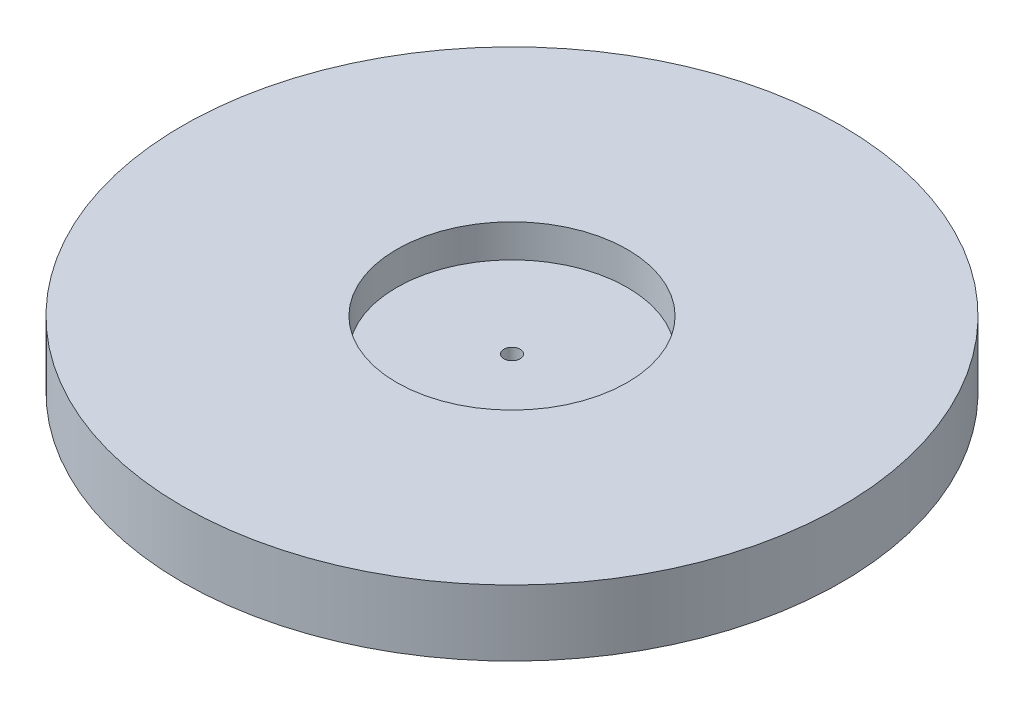
ISO-10303-21;
HEADER;
FILE_DESCRIPTION(('STEP AP214'),'2;1');
FILE_NAME('part.step','',(''),(''),'','','');
FILE_SCHEMA(('AUTOMOTIVE_DESIGN { 1 0 10303 214 1 1 1 1 }'));
ENDSEC;
DATA;
#1=APPLICATION_CONTEXT('core data for automotive mechanical design processes');
#2=APPLICATION_PROTOCOL_DEFINITION('international standard','automotive_design',2000,#1);
#3=PRODUCT_CONTEXT('',#1,'mechanical');
#4=PRODUCT('Part','Part','',(#3));
#5=PRODUCT_RELATED_PRODUCT_CATEGORY('part','',(#4));
#6=PRODUCT_DEFINITION_FORMATION('','',#4);
#7=PRODUCT_DEFINITION_CONTEXT('part definition',#1,'design');
#8=PRODUCT_DEFINITION('design','',#6,#7);
#9=PRODUCT_DEFINITION_SHAPE('','',#8);
#10=(LENGTH_UNIT() NAMED_UNIT(*) SI_UNIT(.MILLI.,.METRE.));
#11=(NAMED_UNIT(*) PLANE_ANGLE_UNIT() SI_UNIT($,.RADIAN.));
#12=(NAMED_UNIT(*) SI_UNIT($,.STERADIAN.) SOLID_ANGLE_UNIT());
#13=UNCERTAINTY_MEASURE_WITH_UNIT(LENGTH_MEASURE(1.E-05),#10,'distance_accuracy_value','');
#14=(GEOMETRIC_REPRESENTATION_CONTEXT(3) GLOBAL_UNCERTAINTY_ASSIGNED_CONTEXT((#13)) GLOBAL_UNIT_ASSIGNED_CONTEXT((#10,
#11,#12)) REPRESENTATION_CONTEXT('',''));
#15=CARTESIAN_POINT('',(0.,0.,0.));
#16=DIRECTION('',(0.,0.,1.));
#17=DIRECTION('',(1.,0.,0.));
#18=AXIS2_PLACEMENT_3D('',#15,#16,#17);
#19=CARTESIAN_POINT('',(0.,25.4,0.));
#20=DIRECTION('',(0.,-1.,0.));
#21=DIRECTION('',(0.,0.,-1.));
#22=AXIS2_PLACEMENT_3D('',#19,#20,#21);
#23=CYLINDRICAL_SURFACE('',#22,3.175);
#24=CARTESIAN_POINT('',(0.,0.,0.));
#25=DIRECTION('',(0.,1.,0.));
#26=DIRECTION('',(0.,0.,1.));
#27=AXIS2_PLACEMENT_3D('',#24,#25,#26);
#28=CIRCLE('',#27,3.175);
#29=CARTESIAN_POINT('',(0.,0.,3.175));
#30=VERTEX_POINT('',#29);
#31=EDGE_CURVE('E45',#30,#30,#28,.T.);
#32=ORIENTED_EDGE('',*,*,#31,.F.);
#33=EDGE_LOOP('',(#32));
#34=FACE_BOUND('',#33,.T.);
#35=CARTESIAN_POINT('',(0.,12.7,0.));
#36=DIRECTION('',(0.,1.,0.));
#37=DIRECTION('',(0.,0.,1.));
#38=AXIS2_PLACEMENT_3D('',#35,#36,#37);
#39=CIRCLE('',#38,3.175);
#40=CARTESIAN_POINT('',(0.,12.7,3.175));
#41=VERTEX_POINT('',#40);
#42=EDGE_CURVE('E36',#41,#41,#39,.T.);
#43=ORIENTED_EDGE('',*,*,#42,.T.);
#44=EDGE_LOOP('',(#43));
#45=FACE_BOUND('',#44,.T.);
#46=ADVANCED_FACE('F32',(#34,#45),#23,.F.);
#47=CARTESIAN_POINT('',(0.,25.4,0.));
#48=DIRECTION('',(0.,1.,0.));
#49=DIRECTION('',(0.,0.,1.));
#50=AXIS2_PLACEMENT_3D('',#47,#48,#49);
#51=PLANE('',#50);
#52=CARTESIAN_POINT('',(0.,25.4,0.));
#53=DIRECTION('',(0.,1.,0.));
#54=DIRECTION('',(0.,0.,1.));
#55=AXIS2_PLACEMENT_3D('',#52,#53,#54);
#56=CIRCLE('',#55,44.45);
#57=CARTESIAN_POINT('',(0.,25.4,44.45));
#58=VERTEX_POINT('',#57);
#59=EDGE_CURVE('E49',#58,#58,#56,.T.);
#60=ORIENTED_EDGE('',*,*,#59,.F.);
#61=EDGE_LOOP('',(#60));
#62=FACE_BOUND('',#61,.T.);
#63=CARTESIAN_POINT('',(0.,25.4,0.));
#64=DIRECTION('',(0.,1.,0.));
#65=DIRECTION('',(0.,0.,1.));
#66=AXIS2_PLACEMENT_3D('',#63,#64,#65);
#67=CIRCLE('',#66,127.);
#68=CARTESIAN_POINT('',(0.,25.4,127.));
#69=VERTEX_POINT('',#68);
#70=EDGE_CURVE('E10',#69,#69,#67,.T.);
#71=ORIENTED_EDGE('',*,*,#70,.T.);
#72=EDGE_LOOP('',(#71));
#73=FACE_BOUND('',#72,.T.);
#74=ADVANCED_FACE('F70',(#62,#73),#51,.T.);
#75=CARTESIAN_POINT('',(0.,0.,0.));
#76=DIRECTION('',(0.,1.,0.));
#77=DIRECTION('',(0.,0.,1.));
#78=AXIS2_PLACEMENT_3D('',#75,#76,#77);
#79=PLANE('',#78);
#80=CARTESIAN_POINT('',(0.,0.,0.));
#81=DIRECTION('',(0.,1.,0.));
#82=DIRECTION('',(0.,0.,1.));
#83=AXIS2_PLACEMENT_3D('',#80,#81,#82);
#84=CIRCLE('',#83,127.);
#85=CARTESIAN_POINT('',(0.,0.,127.));
#86=VERTEX_POINT('',#85);
#87=EDGE_CURVE('E40',#86,#86,#84,.T.);
#88=ORIENTED_EDGE('',*,*,#87,.F.);
#89=EDGE_LOOP('',(#88));
#90=FACE_BOUND('',#89,.T.);
#91=ORIENTED_EDGE('',*,*,#31,.T.);
#92=EDGE_LOOP('',(#91));
#93=FACE_BOUND('',#92,.T.);
#94=ADVANCED_FACE('F76',(#90,#93),#79,.F.);
#95=CARTESIAN_POINT('',(0.,25.4,0.));
#96=DIRECTION('',(0.,-1.,0.));
#97=DIRECTION('',(0.,0.,-1.));
#98=AXIS2_PLACEMENT_3D('',#95,#96,#97);
#99=CYLINDRICAL_SURFACE('',#98,127.);
#100=ORIENTED_EDGE('',*,*,#70,.F.);
#101=EDGE_LOOP('',(#100));
#102=FACE_BOUND('',#101,.T.);
#103=ORIENTED_EDGE('',*,*,#87,.T.);
#104=EDGE_LOOP('',(#103));
#105=FACE_BOUND('',#104,.T.);
#106=ADVANCED_FACE('F34',(#102,#105),#99,.T.);
#107=CARTESIAN_POINT('',(0.,12.7,0.));
#108=DIRECTION('',(0.,1.,0.));
#109=DIRECTION('',(0.,0.,1.));
#110=AXIS2_PLACEMENT_3D('',#107,#108,#109);
#111=CYLINDRICAL_SURFACE('',#110,44.45);
#112=CARTESIAN_POINT('',(0.,12.7,0.));
#113=DIRECTION('',(0.,1.,0.));
#114=DIRECTION('',(0.,0.,1.));
#115=AXIS2_PLACEMENT_3D('',#112,#113,#114);
#116=CIRCLE('',#115,44.45);
#117=CARTESIAN_POINT('',(0.,12.7,44.45));
#118=VERTEX_POINT('',#117);
#119=EDGE_CURVE('E52',#118,#118,#116,.T.);
#120=ORIENTED_EDGE('',*,*,#119,.F.);
#121=EDGE_LOOP('',(#120));
#122=FACE_BOUND('',#121,.T.);
#123=ORIENTED_EDGE('',*,*,#59,.T.);
#124=EDGE_LOOP('',(#123));
#125=FACE_BOUND('',#124,.T.);
#126=ADVANCED_FACE('F62',(#122,#125),#111,.F.);
#127=CARTESIAN_POINT('',(0.,12.7,0.));
#128=DIRECTION('',(0.,1.,0.));
#129=DIRECTION('',(0.,0.,1.));
#130=AXIS2_PLACEMENT_3D('',#127,#128,#129);
#131=PLANE('',#130);
#132=ORIENTED_EDGE('',*,*,#42,.F.);
#133=EDGE_LOOP('',(#132));
#134=FACE_BOUND('',#133,.T.);
#135=ORIENTED_EDGE('',*,*,#119,.T.);
#136=EDGE_LOOP('',(#135));
#137=FACE_BOUND('',#136,.T.);
#138=ADVANCED_FACE('F60',(#134,#137),#131,.T.);
#139=CLOSED_SHELL('',(#46,#74,#94,#106,#126,#138));
#140=MANIFOLD_SOLID_BREP('B2',#139);
#141=ADVANCED_BREP_SHAPE_REPRESENTATION('',(#18,#140),#14);
#142=SHAPE_DEFINITION_REPRESENTATION(#9,#141);
ENDSEC;
END-ISO-10303-21;
